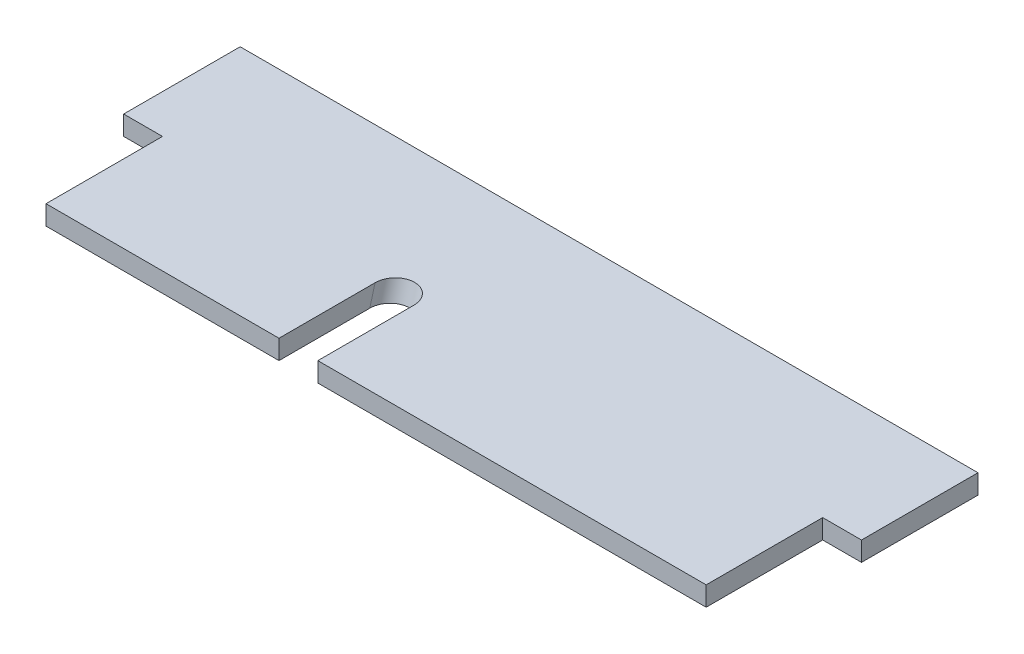
ISO-10303-21;
HEADER;
FILE_DESCRIPTION(('STEP AP214'),'2;1');
FILE_NAME('part.step','',(''),(''),'','','');
FILE_SCHEMA(('AUTOMOTIVE_DESIGN { 1 0 10303 214 1 1 1 1 }'));
ENDSEC;
DATA;
#1=APPLICATION_CONTEXT('core data for automotive mechanical design processes');
#2=APPLICATION_PROTOCOL_DEFINITION('international standard','automotive_design',2000,#1);
#3=PRODUCT_CONTEXT('',#1,'mechanical');
#4=PRODUCT('Part','Part','',(#3));
#5=PRODUCT_RELATED_PRODUCT_CATEGORY('part','',(#4));
#6=PRODUCT_DEFINITION_FORMATION('','',#4);
#7=PRODUCT_DEFINITION_CONTEXT('part definition',#1,'design');
#8=PRODUCT_DEFINITION('design','',#6,#7);
#9=PRODUCT_DEFINITION_SHAPE('','',#8);
#10=(LENGTH_UNIT() NAMED_UNIT(*) SI_UNIT(.MILLI.,.METRE.));
#11=(NAMED_UNIT(*) PLANE_ANGLE_UNIT() SI_UNIT($,.RADIAN.));
#12=(NAMED_UNIT(*) SI_UNIT($,.STERADIAN.) SOLID_ANGLE_UNIT());
#13=UNCERTAINTY_MEASURE_WITH_UNIT(LENGTH_MEASURE(1.E-05),#10,'distance_accuracy_value','');
#14=(GEOMETRIC_REPRESENTATION_CONTEXT(3) GLOBAL_UNCERTAINTY_ASSIGNED_CONTEXT((#13)) GLOBAL_UNIT_ASSIGNED_CONTEXT((#10,
#11,#12)) REPRESENTATION_CONTEXT('',''));
#15=CARTESIAN_POINT('',(0.,0.,0.));
#16=DIRECTION('',(0.,0.,1.));
#17=DIRECTION('',(1.,0.,0.));
#18=AXIS2_PLACEMENT_3D('',#15,#16,#17);
#19=CARTESIAN_POINT('',(-215.9,6.35,76.2));
#20=DIRECTION('',(0.,0.,-1.));
#21=DIRECTION('',(-1.,0.,0.));
#22=AXIS2_PLACEMENT_3D('',#19,#20,#21);
#23=PLANE('',#22);
#24=DIRECTION('',(1.,0.,0.));
#25=VECTOR('',#24,1.);
#26=CARTESIAN_POINT('',(-215.9,-6.35,76.2));
#27=LINE('',#26,#25);
#28=CARTESIAN_POINT('',(-215.9,-6.35,76.2));
#29=VERTEX_POINT('',#28);
#30=CARTESIAN_POINT('',(-63.5,-6.34999999999999,76.2));
#31=VERTEX_POINT('',#30);
#32=EDGE_CURVE('E205',#29,#31,#27,.T.);
#33=ORIENTED_EDGE('',*,*,#32,.T.);
#34=DIRECTION('',(0.,-1.,0.));
#35=VECTOR('',#34,1.);
#36=CARTESIAN_POINT('',(-63.5,6.34999999999999,76.2));
#37=LINE('',#36,#35);
#38=CARTESIAN_POINT('',(-63.5,6.34999999999999,76.2));
#39=VERTEX_POINT('',#38);
#40=EDGE_CURVE('E159',#39,#31,#37,.T.);
#41=ORIENTED_EDGE('',*,*,#40,.F.);
#42=DIRECTION('',(1.,0.,0.));
#43=VECTOR('',#42,1.);
#44=CARTESIAN_POINT('',(-215.9,6.35,76.2));
#45=LINE('',#44,#43);
#46=CARTESIAN_POINT('',(-215.9,6.35,76.2));
#47=VERTEX_POINT('',#46);
#48=EDGE_CURVE('E56',#47,#39,#45,.T.);
#49=ORIENTED_EDGE('',*,*,#48,.F.);
#50=DIRECTION('',(0.,-1.,0.));
#51=VECTOR('',#50,1.);
#52=CARTESIAN_POINT('',(-215.9,6.35,76.2));
#53=LINE('',#52,#51);
#54=EDGE_CURVE('E201',#47,#29,#53,.T.);
#55=ORIENTED_EDGE('',*,*,#54,.T.);
#56=EDGE_LOOP('',(#33,#41,#49,#55));
#57=FACE_BOUND('',#56,.T.);
#58=ADVANCED_FACE('F46',(#57),#23,.F.);
#59=CARTESIAN_POINT('',(215.9,6.35,0.));
#60=DIRECTION('',(-1.,0.,0.));
#61=DIRECTION('',(0.,0.,1.));
#62=AXIS2_PLACEMENT_3D('',#59,#60,#61);
#63=PLANE('',#62);
#64=DIRECTION('',(0.,0.,-1.));
#65=VECTOR('',#64,1.);
#66=CARTESIAN_POINT('',(215.9,-6.35,0.));
#67=LINE('',#66,#65);
#68=CARTESIAN_POINT('',(215.9,-6.35,76.2));
#69=VERTEX_POINT('',#68);
#70=CARTESIAN_POINT('',(215.9,-6.35,0.));
#71=VERTEX_POINT('',#70);
#72=EDGE_CURVE('E185',#69,#71,#67,.T.);
#73=ORIENTED_EDGE('',*,*,#72,.T.);
#74=DIRECTION('',(0.,-1.,0.));
#75=VECTOR('',#74,1.);
#76=CARTESIAN_POINT('',(215.9,6.35,0.));
#77=LINE('',#76,#75);
#78=CARTESIAN_POINT('',(215.9,6.35,0.));
#79=VERTEX_POINT('',#78);
#80=EDGE_CURVE('E238',#79,#71,#77,.T.);
#81=ORIENTED_EDGE('',*,*,#80,.F.);
#82=DIRECTION('',(0.,0.,-1.));
#83=VECTOR('',#82,1.);
#84=CARTESIAN_POINT('',(215.9,6.35,0.));
#85=LINE('',#84,#83);
#86=CARTESIAN_POINT('',(215.9,6.35,76.2));
#87=VERTEX_POINT('',#86);
#88=EDGE_CURVE('E198',#87,#79,#85,.T.);
#89=ORIENTED_EDGE('',*,*,#88,.F.);
#90=DIRECTION('',(0.,-1.,0.));
#91=VECTOR('',#90,1.);
#92=CARTESIAN_POINT('',(215.9,6.35,76.2));
#93=LINE('',#92,#91);
#94=EDGE_CURVE('E173',#87,#69,#93,.T.);
#95=ORIENTED_EDGE('',*,*,#94,.T.);
#96=EDGE_LOOP('',(#73,#81,#89,#95));
#97=FACE_BOUND('',#96,.T.);
#98=ADVANCED_FACE('F273',(#97),#63,.F.);
#99=CARTESIAN_POINT('',(215.9,6.35,0.));
#100=DIRECTION('',(0.,0.,-1.));
#101=DIRECTION('',(-1.,0.,0.));
#102=AXIS2_PLACEMENT_3D('',#99,#100,#101);
#103=PLANE('',#102);
#104=DIRECTION('',(1.,0.,0.));
#105=VECTOR('',#104,1.);
#106=CARTESIAN_POINT('',(215.9,-6.35,0.));
#107=LINE('',#106,#105);
#108=CARTESIAN_POINT('',(241.3,-6.35,0.));
#109=VERTEX_POINT('',#108);
#110=EDGE_CURVE('E220',#71,#109,#107,.T.);
#111=ORIENTED_EDGE('',*,*,#110,.T.);
#112=DIRECTION('',(0.,-1.,0.));
#113=VECTOR('',#112,1.);
#114=CARTESIAN_POINT('',(241.3,6.35,0.));
#115=LINE('',#114,#113);
#116=CARTESIAN_POINT('',(241.3,6.35,0.));
#117=VERTEX_POINT('',#116);
#118=EDGE_CURVE('E235',#117,#109,#115,.T.);
#119=ORIENTED_EDGE('',*,*,#118,.F.);
#120=DIRECTION('',(1.,0.,0.));
#121=VECTOR('',#120,1.);
#122=CARTESIAN_POINT('',(215.9,6.35,0.));
#123=LINE('',#122,#121);
#124=EDGE_CURVE('E197',#79,#117,#123,.T.);
#125=ORIENTED_EDGE('',*,*,#124,.F.);
#126=ORIENTED_EDGE('',*,*,#80,.T.);
#127=EDGE_LOOP('',(#111,#119,#125,#126));
#128=FACE_BOUND('',#127,.T.);
#129=ADVANCED_FACE('F296',(#128),#103,.F.);
#130=CARTESIAN_POINT('',(241.3,6.35,-76.2));
#131=DIRECTION('',(-1.,0.,0.));
#132=DIRECTION('',(0.,0.,1.));
#133=AXIS2_PLACEMENT_3D('',#130,#131,#132);
#134=PLANE('',#133);
#135=DIRECTION('',(0.,0.,-1.));
#136=VECTOR('',#135,1.);
#137=CARTESIAN_POINT('',(241.3,-6.35,-76.2));
#138=LINE('',#137,#136);
#139=CARTESIAN_POINT('',(241.3,-6.35,-76.2));
#140=VERTEX_POINT('',#139);
#141=EDGE_CURVE('E236',#109,#140,#138,.T.);
#142=ORIENTED_EDGE('',*,*,#141,.T.);
#143=DIRECTION('',(0.,-1.,0.));
#144=VECTOR('',#143,1.);
#145=CARTESIAN_POINT('',(241.3,6.35,-76.2));
#146=LINE('',#145,#144);
#147=CARTESIAN_POINT('',(241.3,6.35,-76.2));
#148=VERTEX_POINT('',#147);
#149=EDGE_CURVE('E232',#148,#140,#146,.T.);
#150=ORIENTED_EDGE('',*,*,#149,.F.);
#151=DIRECTION('',(0.,0.,-1.));
#152=VECTOR('',#151,1.);
#153=CARTESIAN_POINT('',(241.3,6.35,-76.2));
#154=LINE('',#153,#152);
#155=EDGE_CURVE('E195',#117,#148,#154,.T.);
#156=ORIENTED_EDGE('',*,*,#155,.F.);
#157=ORIENTED_EDGE('',*,*,#118,.T.);
#158=EDGE_LOOP('',(#142,#150,#156,#157));
#159=FACE_BOUND('',#158,.T.);
#160=ADVANCED_FACE('F294',(#159),#134,.F.);
#161=CARTESIAN_POINT('',(-215.9,6.35,-76.2));
#162=DIRECTION('',(0.,0.,1.));
#163=DIRECTION('',(1.,0.,0.));
#164=AXIS2_PLACEMENT_3D('',#161,#162,#163);
#165=PLANE('',#164);
#166=DIRECTION('',(-1.,0.,0.));
#167=VECTOR('',#166,1.);
#168=CARTESIAN_POINT('',(-215.9,-6.35,-76.2));
#169=LINE('',#168,#167);
#170=CARTESIAN_POINT('',(-241.3,-6.35,-76.2));
#171=VERTEX_POINT('',#170);
#172=EDGE_CURVE('E233',#140,#171,#169,.T.);
#173=ORIENTED_EDGE('',*,*,#172,.T.);
#174=DIRECTION('',(0.,-1.,0.));
#175=VECTOR('',#174,1.);
#176=CARTESIAN_POINT('',(-241.3,6.35,-76.2));
#177=LINE('',#176,#175);
#178=CARTESIAN_POINT('',(-241.3,6.35,-76.2));
#179=VERTEX_POINT('',#178);
#180=EDGE_CURVE('E228',#179,#171,#177,.T.);
#181=ORIENTED_EDGE('',*,*,#180,.F.);
#182=DIRECTION('',(-1.,0.,0.));
#183=VECTOR('',#182,1.);
#184=CARTESIAN_POINT('',(215.9,6.35,-76.2));
#185=LINE('',#184,#183);
#186=EDGE_CURVE('E193',#148,#179,#185,.T.);
#187=ORIENTED_EDGE('',*,*,#186,.F.);
#188=ORIENTED_EDGE('',*,*,#149,.T.);
#189=EDGE_LOOP('',(#173,#181,#187,#188));
#190=FACE_BOUND('',#189,.T.);
#191=ADVANCED_FACE('F291',(#190),#165,.F.);
#192=CARTESIAN_POINT('',(-241.3,6.35,-76.2));
#193=DIRECTION('',(1.,0.,0.));
#194=DIRECTION('',(0.,0.,-1.));
#195=AXIS2_PLACEMENT_3D('',#192,#193,#194);
#196=PLANE('',#195);
#197=DIRECTION('',(0.,0.,1.));
#198=VECTOR('',#197,1.);
#199=CARTESIAN_POINT('',(-241.3,-6.35,-76.2));
#200=LINE('',#199,#198);
#201=CARTESIAN_POINT('',(-241.3,-6.35,0.));
#202=VERTEX_POINT('',#201);
#203=EDGE_CURVE('E229',#171,#202,#200,.T.);
#204=ORIENTED_EDGE('',*,*,#203,.T.);
#205=DIRECTION('',(0.,-1.,0.));
#206=VECTOR('',#205,1.);
#207=CARTESIAN_POINT('',(-241.3,6.35,0.));
#208=LINE('',#207,#206);
#209=CARTESIAN_POINT('',(-241.3,6.35,0.));
#210=VERTEX_POINT('',#209);
#211=EDGE_CURVE('E224',#210,#202,#208,.T.);
#212=ORIENTED_EDGE('',*,*,#211,.F.);
#213=DIRECTION('',(0.,0.,1.));
#214=VECTOR('',#213,1.);
#215=CARTESIAN_POINT('',(-241.3,6.35,-76.2));
#216=LINE('',#215,#214);
#217=EDGE_CURVE('E190',#179,#210,#216,.T.);
#218=ORIENTED_EDGE('',*,*,#217,.F.);
#219=ORIENTED_EDGE('',*,*,#180,.T.);
#220=EDGE_LOOP('',(#204,#212,#218,#219));
#221=FACE_BOUND('',#220,.T.);
#222=ADVANCED_FACE('F289',(#221),#196,.F.);
#223=CARTESIAN_POINT('',(-215.9,6.35,0.));
#224=DIRECTION('',(0.,0.,-1.));
#225=DIRECTION('',(-1.,0.,0.));
#226=AXIS2_PLACEMENT_3D('',#223,#224,#225);
#227=PLANE('',#226);
#228=DIRECTION('',(1.,0.,0.));
#229=VECTOR('',#228,1.);
#230=CARTESIAN_POINT('',(-215.9,-6.35,0.));
#231=LINE('',#230,#229);
#232=CARTESIAN_POINT('',(-215.9,-6.35,0.));
#233=VERTEX_POINT('',#232);
#234=EDGE_CURVE('E225',#202,#233,#231,.T.);
#235=ORIENTED_EDGE('',*,*,#234,.T.);
#236=DIRECTION('',(0.,-1.,0.));
#237=VECTOR('',#236,1.);
#238=CARTESIAN_POINT('',(-215.9,6.35,0.));
#239=LINE('',#238,#237);
#240=CARTESIAN_POINT('',(-215.9,6.35,0.));
#241=VERTEX_POINT('',#240);
#242=EDGE_CURVE('E218',#241,#233,#239,.T.);
#243=ORIENTED_EDGE('',*,*,#242,.F.);
#244=DIRECTION('',(1.,0.,0.));
#245=VECTOR('',#244,1.);
#246=CARTESIAN_POINT('',(-215.9,6.35,0.));
#247=LINE('',#246,#245);
#248=EDGE_CURVE('E182',#210,#241,#247,.T.);
#249=ORIENTED_EDGE('',*,*,#248,.F.);
#250=ORIENTED_EDGE('',*,*,#211,.T.);
#251=EDGE_LOOP('',(#235,#243,#249,#250));
#252=FACE_BOUND('',#251,.T.);
#253=ADVANCED_FACE('F257',(#252),#227,.F.);
#254=CARTESIAN_POINT('',(-215.9,6.35,0.));
#255=DIRECTION('',(1.,0.,0.));
#256=DIRECTION('',(0.,0.,-1.));
#257=AXIS2_PLACEMENT_3D('',#254,#255,#256);
#258=PLANE('',#257);
#259=DIRECTION('',(0.,0.,1.));
#260=VECTOR('',#259,1.);
#261=CARTESIAN_POINT('',(-215.9,-6.35,0.));
#262=LINE('',#261,#260);
#263=EDGE_CURVE('E222',#233,#29,#262,.T.);
#264=ORIENTED_EDGE('',*,*,#263,.T.);
#265=ORIENTED_EDGE('',*,*,#54,.F.);
#266=DIRECTION('',(0.,0.,1.));
#267=VECTOR('',#266,1.);
#268=CARTESIAN_POINT('',(-215.9,6.35,0.));
#269=LINE('',#268,#267);
#270=EDGE_CURVE('E176',#241,#47,#269,.T.);
#271=ORIENTED_EDGE('',*,*,#270,.F.);
#272=ORIENTED_EDGE('',*,*,#242,.T.);
#273=EDGE_LOOP('',(#264,#265,#271,#272));
#274=FACE_BOUND('',#273,.T.);
#275=ADVANCED_FACE('F268',(#274),#258,.F.);
#276=CARTESIAN_POINT('',(-38.0999999999998,6.34999999999999,76.2));
#277=VERTEX_POINT('',#276);
#278=EDGE_CURVE('E165',#277,#87,#45,.T.);
#279=ORIENTED_EDGE('',*,*,#278,.F.);
#280=DIRECTION('',(0.,1.,0.));
#281=VECTOR('',#280,1.);
#282=CARTESIAN_POINT('',(-38.0999999999998,6.34999999999999,76.2));
#283=LINE('',#282,#281);
#284=CARTESIAN_POINT('',(-38.0999999999998,-6.35,76.2));
#285=VERTEX_POINT('',#284);
#286=EDGE_CURVE('E150',#285,#277,#283,.T.);
#287=ORIENTED_EDGE('',*,*,#286,.F.);
#288=EDGE_CURVE('E214',#285,#69,#27,.T.);
#289=ORIENTED_EDGE('',*,*,#288,.T.);
#290=ORIENTED_EDGE('',*,*,#94,.F.);
#291=EDGE_LOOP('',(#279,#287,#289,#290));
#292=FACE_BOUND('',#291,.T.);
#293=ADVANCED_FACE('F171',(#292),#23,.F.);
#294=CARTESIAN_POINT('',(0.,6.35,0.));
#295=DIRECTION('',(0.,1.,0.));
#296=DIRECTION('',(0.,0.,1.));
#297=AXIS2_PLACEMENT_3D('',#294,#295,#296);
#298=PLANE('',#297);
#299=DIRECTION('',(0.,0.,1.));
#300=VECTOR('',#299,1.);
#301=CARTESIAN_POINT('',(-63.5,6.34999999999999,-76.201));
#302=LINE('',#301,#300);
#303=CARTESIAN_POINT('',(-63.4999999999993,6.34999999999999,13.3639769330719));
#304=VERTEX_POINT('',#303);
#305=EDGE_CURVE('E169',#304,#39,#302,.T.);
#306=ORIENTED_EDGE('',*,*,#305,.F.);
#307=CARTESIAN_POINT('',(-50.7999999999986,6.34999999999999,13.3639769330719));
#308=DIRECTION('',(0.,1.,0.));
#309=DIRECTION('',(0.,0.,-1.));
#310=AXIS2_PLACEMENT_3D('',#307,#308,#309);
#311=ELLIPSE('',#310,13.1581302597941,12.7000000000001);
#312=CARTESIAN_POINT('',(-38.0999999999985,6.34999999999999,13.3639769330719));
#313=VERTEX_POINT('',#312);
#314=EDGE_CURVE('E50',#304,#313,#311,.F.);
#315=ORIENTED_EDGE('',*,*,#314,.T.);
#316=DIRECTION('',(0.,0.,1.));
#317=VECTOR('',#316,1.);
#318=CARTESIAN_POINT('',(-38.0999999999998,6.34999999999999,-76.201));
#319=LINE('',#318,#317);
#320=EDGE_CURVE('E77',#313,#277,#319,.T.);
#321=ORIENTED_EDGE('',*,*,#320,.T.);
#322=ORIENTED_EDGE('',*,*,#278,.T.);
#323=ORIENTED_EDGE('',*,*,#88,.T.);
#324=ORIENTED_EDGE('',*,*,#124,.T.);
#325=ORIENTED_EDGE('',*,*,#155,.T.);
#326=ORIENTED_EDGE('',*,*,#186,.T.);
#327=ORIENTED_EDGE('',*,*,#217,.T.);
#328=ORIENTED_EDGE('',*,*,#248,.T.);
#329=ORIENTED_EDGE('',*,*,#270,.T.);
#330=ORIENTED_EDGE('',*,*,#48,.T.);
#331=EDGE_LOOP('',(#306,#315,#321,#322,#323,#324,#325,#326,#327,#328,#329,#330));
#332=FACE_BOUND('',#331,.T.);
#333=ADVANCED_FACE('F48',(#332),#298,.T.);
#334=CARTESIAN_POINT('',(0.,-6.35,0.));
#335=DIRECTION('',(0.,1.,0.));
#336=DIRECTION('',(0.,0.,1.));
#337=AXIS2_PLACEMENT_3D('',#334,#335,#336);
#338=PLANE('',#337);
#339=CARTESIAN_POINT('',(-50.7999999999986,-6.34999999999999,16.8058357235667));
#340=DIRECTION('',(0.,1.,0.));
#341=DIRECTION('',(0.,0.,-1.));
#342=AXIS2_PLACEMENT_3D('',#339,#340,#341);
#343=ELLIPSE('',#342,13.1581302597941,12.7000000000001);
#344=CARTESIAN_POINT('',(-63.4999999999987,-6.34999999999999,16.8058357235667));
#345=VERTEX_POINT('',#344);
#346=CARTESIAN_POINT('',(-38.0999999999985,-6.34999999999999,16.8058357235667));
#347=VERTEX_POINT('',#346);
#348=EDGE_CURVE('E11',#345,#347,#343,.F.);
#349=ORIENTED_EDGE('',*,*,#348,.F.);
#350=DIRECTION('',(0.,0.,1.));
#351=VECTOR('',#350,1.);
#352=CARTESIAN_POINT('',(-63.5,-6.34999999999999,-76.201));
#353=LINE('',#352,#351);
#354=EDGE_CURVE('E67',#345,#31,#353,.T.);
#355=ORIENTED_EDGE('',*,*,#354,.T.);
#356=ORIENTED_EDGE('',*,*,#32,.F.);
#357=ORIENTED_EDGE('',*,*,#263,.F.);
#358=ORIENTED_EDGE('',*,*,#234,.F.);
#359=ORIENTED_EDGE('',*,*,#203,.F.);
#360=ORIENTED_EDGE('',*,*,#172,.F.);
#361=ORIENTED_EDGE('',*,*,#141,.F.);
#362=ORIENTED_EDGE('',*,*,#110,.F.);
#363=ORIENTED_EDGE('',*,*,#72,.F.);
#364=ORIENTED_EDGE('',*,*,#288,.F.);
#365=DIRECTION('',(0.,0.,1.));
#366=VECTOR('',#365,1.);
#367=CARTESIAN_POINT('',(-38.0999999999998,-6.35,-76.201));
#368=LINE('',#367,#366);
#369=EDGE_CURVE('E153',#347,#285,#368,.T.);
#370=ORIENTED_EDGE('',*,*,#369,.F.);
#371=EDGE_LOOP('',(#349,#355,#356,#357,#358,#359,#360,#361,#362,#363,#364,#370));
#372=FACE_BOUND('',#371,.T.);
#373=ADVANCED_FACE('F266',(#372),#338,.F.);
#374=CARTESIAN_POINT('',(-50.7999999999986,-171.450000000005,61.5499999999998));
#375=DIRECTION('',(0.,0.965182723476006,-0.261576585923588));
#376=DIRECTION('',(0.,-0.261576585923588,-0.965182723476006));
#377=AXIS2_PLACEMENT_3D('',#374,#375,#376);
#378=CYLINDRICAL_SURFACE('',#377,12.7000000000001);
#379=DIRECTION('',(0.,0.965182723476006,-0.261576585923588));
#380=VECTOR('',#379,1.);
#381=CARTESIAN_POINT('',(-63.4999999999994,-171.450000000005,61.5499999999998));
#382=LINE('',#381,#380);
#383=EDGE_CURVE('E158',#304,#345,#382,.F.);
#384=ORIENTED_EDGE('',*,*,#383,.T.);
#385=ORIENTED_EDGE('',*,*,#348,.T.);
#386=DIRECTION('',(0.,0.965182723476006,-0.261576585923588));
#387=VECTOR('',#386,1.);
#388=CARTESIAN_POINT('',(-38.0999999999991,-171.450000000005,61.5499999999998));
#389=LINE('',#388,#387);
#390=EDGE_CURVE('E275',#313,#347,#389,.F.);
#391=ORIENTED_EDGE('',*,*,#390,.F.);
#392=ORIENTED_EDGE('',*,*,#314,.F.);
#393=EDGE_LOOP('',(#384,#385,#391,#392));
#394=FACE_BOUND('',#393,.T.);
#395=ADVANCED_FACE('F370',(#394),#378,.F.);
#396=CARTESIAN_POINT('',(-38.0999999999998,6.34999999999999,-76.201));
#397=DIRECTION('',(1.,0.,0.));
#398=DIRECTION('',(0.,1.,0.));
#399=AXIS2_PLACEMENT_3D('',#396,#397,#398);
#400=PLANE('',#399);
#401=ORIENTED_EDGE('',*,*,#390,.T.);
#402=ORIENTED_EDGE('',*,*,#369,.T.);
#403=ORIENTED_EDGE('',*,*,#286,.T.);
#404=ORIENTED_EDGE('',*,*,#320,.F.);
#405=EDGE_LOOP('',(#401,#402,#403,#404));
#406=FACE_BOUND('',#405,.T.);
#407=ADVANCED_FACE('F151',(#406),#400,.F.);
#408=CARTESIAN_POINT('',(-63.5,6.34999999999999,-76.201));
#409=DIRECTION('',(-1.,0.,0.));
#410=DIRECTION('',(0.,0.,1.));
#411=AXIS2_PLACEMENT_3D('',#408,#409,#410);
#412=PLANE('',#411);
#413=ORIENTED_EDGE('',*,*,#305,.T.);
#414=ORIENTED_EDGE('',*,*,#40,.T.);
#415=ORIENTED_EDGE('',*,*,#354,.F.);
#416=ORIENTED_EDGE('',*,*,#383,.F.);
#417=EDGE_LOOP('',(#413,#414,#415,#416));
#418=FACE_BOUND('',#417,.T.);
#419=ADVANCED_FACE('F386',(#418),#412,.F.);
#420=CLOSED_SHELL('',(#58,#98,#129,#160,#191,#222,#253,#275,#293,#333,#373,#395,#407,#419));
#421=MANIFOLD_SOLID_BREP('B2',#420);
#422=ADVANCED_BREP_SHAPE_REPRESENTATION('',(#18,#421),#14);
#423=SHAPE_DEFINITION_REPRESENTATION(#9,#422);
ENDSEC;
END-ISO-10303-21;
